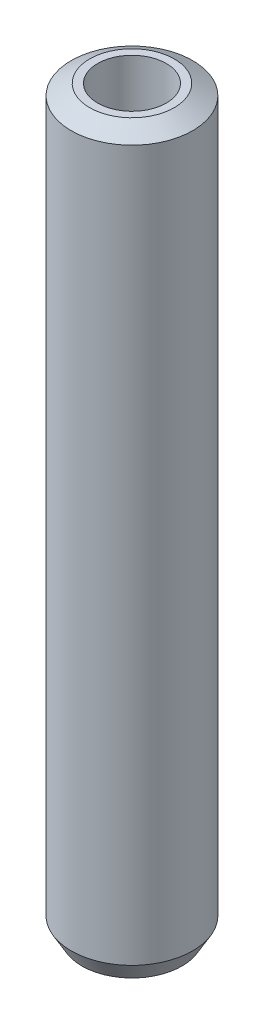
ISO-10303-21;
HEADER;
FILE_DESCRIPTION(('STEP AP214'),'2;1');
FILE_NAME('part.step','',(''),(''),'','','');
FILE_SCHEMA(('AUTOMOTIVE_DESIGN { 1 0 10303 214 1 1 1 1 }'));
ENDSEC;
DATA;
#1=APPLICATION_CONTEXT('core data for automotive mechanical design processes');
#2=APPLICATION_PROTOCOL_DEFINITION('international standard','automotive_design',2000,#1);
#3=PRODUCT_CONTEXT('',#1,'mechanical');
#4=PRODUCT('Part','Part','',(#3));
#5=PRODUCT_RELATED_PRODUCT_CATEGORY('part','',(#4));
#6=PRODUCT_DEFINITION_FORMATION('','',#4);
#7=PRODUCT_DEFINITION_CONTEXT('part definition',#1,'design');
#8=PRODUCT_DEFINITION('design','',#6,#7);
#9=PRODUCT_DEFINITION_SHAPE('','',#8);
#10=(LENGTH_UNIT() NAMED_UNIT(*) SI_UNIT(.MILLI.,.METRE.));
#11=(NAMED_UNIT(*) PLANE_ANGLE_UNIT() SI_UNIT($,.RADIAN.));
#12=(NAMED_UNIT(*) SI_UNIT($,.STERADIAN.) SOLID_ANGLE_UNIT());
#13=UNCERTAINTY_MEASURE_WITH_UNIT(LENGTH_MEASURE(1.E-05),#10,'distance_accuracy_value','');
#14=(GEOMETRIC_REPRESENTATION_CONTEXT(3) GLOBAL_UNCERTAINTY_ASSIGNED_CONTEXT((#13)) GLOBAL_UNIT_ASSIGNED_CONTEXT((#10,
#11,#12)) REPRESENTATION_CONTEXT('',''));
#15=CARTESIAN_POINT('',(0.,0.,0.));
#16=DIRECTION('',(0.,0.,1.));
#17=DIRECTION('',(1.,0.,0.));
#18=AXIS2_PLACEMENT_3D('',#15,#16,#17);
#19=CARTESIAN_POINT('',(0.,91.2657420478585,0.));
#20=DIRECTION('',(0.,-1.,0.));
#21=DIRECTION('',(0.,0.,-1.));
#22=AXIS2_PLACEMENT_3D('',#19,#20,#21);
#23=CYLINDRICAL_SURFACE('',#22,7.5);
#24=CARTESIAN_POINT('',(0.,89.9482224756998,0.));
#25=DIRECTION('',(0.,1.,0.));
#26=DIRECTION('',(0.,0.,1.));
#27=AXIS2_PLACEMENT_3D('',#24,#25,#26);
#28=CIRCLE('',#27,7.5);
#29=CARTESIAN_POINT('',(0.,89.9482224756998,7.5));
#30=VERTEX_POINT('',#29);
#31=EDGE_CURVE('E50',#30,#30,#28,.F.);
#32=ORIENTED_EDGE('',*,*,#31,.T.);
#33=EDGE_LOOP('',(#32));
#34=FACE_BOUND('',#33,.T.);
#35=CARTESIAN_POINT('',(0.,2.28201083894528,0.));
#36=DIRECTION('',(0.,1.,0.));
#37=DIRECTION('',(0.,0.,1.));
#38=AXIS2_PLACEMENT_3D('',#35,#36,#37);
#39=CIRCLE('',#38,7.5);
#40=CARTESIAN_POINT('',(0.,2.28201083894528,7.5));
#41=VERTEX_POINT('',#40);
#42=EDGE_CURVE('E51',#41,#41,#39,.T.);
#43=ORIENTED_EDGE('',*,*,#42,.T.);
#44=EDGE_LOOP('',(#43));
#45=FACE_BOUND('',#44,.T.);
#46=ADVANCED_FACE('F39',(#34,#45),#23,.T.);
#47=CARTESIAN_POINT('',(0.,91.2657420478585,0.));
#48=DIRECTION('',(0.,1.,0.));
#49=DIRECTION('',(0.,0.,1.));
#50=AXIS2_PLACEMENT_3D('',#47,#48,#49);
#51=PLANE('',#50);
#52=CARTESIAN_POINT('',(0.,91.2657420478585,0.));
#53=DIRECTION('',(0.,1.,0.));
#54=DIRECTION('',(0.,0.,1.));
#55=AXIS2_PLACEMENT_3D('',#52,#53,#54);
#56=CIRCLE('',#55,5.21798916105472);
#57=CARTESIAN_POINT('',(0.,91.2657420478585,5.21798916105472));
#58=VERTEX_POINT('',#57);
#59=EDGE_CURVE('E54',#58,#58,#56,.T.);
#60=ORIENTED_EDGE('',*,*,#59,.T.);
#61=EDGE_LOOP('',(#60));
#62=FACE_BOUND('',#61,.T.);
#63=CARTESIAN_POINT('',(0.,91.2657420478585,0.));
#64=DIRECTION('',(0.,1.,0.));
#65=DIRECTION('',(0.,0.,1.));
#66=AXIS2_PLACEMENT_3D('',#63,#64,#65);
#67=CIRCLE('',#66,4.23706616966724);
#68=CARTESIAN_POINT('',(0.,91.2657420478585,4.23706616966724));
#69=VERTEX_POINT('',#68);
#70=EDGE_CURVE('E58',#69,#69,#67,.T.);
#71=ORIENTED_EDGE('',*,*,#70,.F.);
#72=EDGE_LOOP('',(#71));
#73=FACE_BOUND('',#72,.T.);
#74=ADVANCED_FACE('F69',(#62,#73),#51,.T.);
#75=CARTESIAN_POINT('',(0.,0.,0.));
#76=DIRECTION('',(0.,1.,0.));
#77=DIRECTION('',(0.,0.,1.));
#78=AXIS2_PLACEMENT_3D('',#75,#76,#77);
#79=PLANE('',#78);
#80=CARTESIAN_POINT('',(0.,0.,0.));
#81=DIRECTION('',(0.,1.,0.));
#82=DIRECTION('',(0.,0.,1.));
#83=AXIS2_PLACEMENT_3D('',#80,#81,#82);
#84=CIRCLE('',#83,6.1824804278413);
#85=CARTESIAN_POINT('',(0.,0.,6.1824804278413));
#86=VERTEX_POINT('',#85);
#87=EDGE_CURVE('E10',#86,#86,#84,.F.);
#88=ORIENTED_EDGE('',*,*,#87,.T.);
#89=EDGE_LOOP('',(#88));
#90=FACE_BOUND('',#89,.T.);
#91=CARTESIAN_POINT('',(0.,0.,0.));
#92=DIRECTION('',(0.,1.,0.));
#93=DIRECTION('',(0.,0.,1.));
#94=AXIS2_PLACEMENT_3D('',#91,#92,#93);
#95=CIRCLE('',#94,4.23706616966724);
#96=CARTESIAN_POINT('',(0.,0.,4.23706616966724));
#97=VERTEX_POINT('',#96);
#98=EDGE_CURVE('E63',#97,#97,#95,.T.);
#99=ORIENTED_EDGE('',*,*,#98,.T.);
#100=EDGE_LOOP('',(#99));
#101=FACE_BOUND('',#100,.T.);
#102=ADVANCED_FACE('F75',(#90,#101),#79,.F.);
#103=CARTESIAN_POINT('',(0.,91.2657420478585,0.));
#104=DIRECTION('',(0.,-1.,0.));
#105=DIRECTION('',(0.,0.,-1.));
#106=AXIS2_PLACEMENT_3D('',#103,#104,#105);
#107=CYLINDRICAL_SURFACE('',#106,4.23706616966724);
#108=ORIENTED_EDGE('',*,*,#70,.T.);
#109=EDGE_LOOP('',(#108));
#110=FACE_BOUND('',#109,.T.);
#111=ORIENTED_EDGE('',*,*,#98,.F.);
#112=EDGE_LOOP('',(#111));
#113=FACE_BOUND('',#112,.T.);
#114=ADVANCED_FACE('F70',(#110,#113),#107,.F.);
#115=CARTESIAN_POINT('',(0.,91.2657420478585,0.));
#116=DIRECTION('',(0.,-1.,0.));
#117=DIRECTION('',(0.,0.,-1.));
#118=AXIS2_PLACEMENT_3D('',#115,#116,#117);
#119=CONICAL_SURFACE('',#118,5.21798916105472,1.04719755119659);
#120=ORIENTED_EDGE('',*,*,#31,.F.);
#121=EDGE_LOOP('',(#120));
#122=FACE_BOUND('',#121,.T.);
#123=ORIENTED_EDGE('',*,*,#59,.F.);
#124=EDGE_LOOP('',(#123));
#125=FACE_BOUND('',#124,.T.);
#126=ADVANCED_FACE('F81',(#122,#125),#119,.T.);
#127=CARTESIAN_POINT('',(0.,2.28201083894528,0.));
#128=DIRECTION('',(0.,1.,0.));
#129=DIRECTION('',(0.,0.,1.));
#130=AXIS2_PLACEMENT_3D('',#127,#128,#129);
#131=CONICAL_SURFACE('',#130,7.5,0.523598775598299);
#132=ORIENTED_EDGE('',*,*,#87,.F.);
#133=EDGE_LOOP('',(#132));
#134=FACE_BOUND('',#133,.T.);
#135=ORIENTED_EDGE('',*,*,#42,.F.);
#136=EDGE_LOOP('',(#135));
#137=FACE_BOUND('',#136,.T.);
#138=ADVANCED_FACE('F45',(#134,#137),#131,.T.);
#139=CLOSED_SHELL('',(#46,#74,#102,#114,#126,#138));
#140=MANIFOLD_SOLID_BREP('B2',#139);
#141=ADVANCED_BREP_SHAPE_REPRESENTATION('',(#18,#140),#14);
#142=SHAPE_DEFINITION_REPRESENTATION(#9,#141);
ENDSEC;
END-ISO-10303-21;
